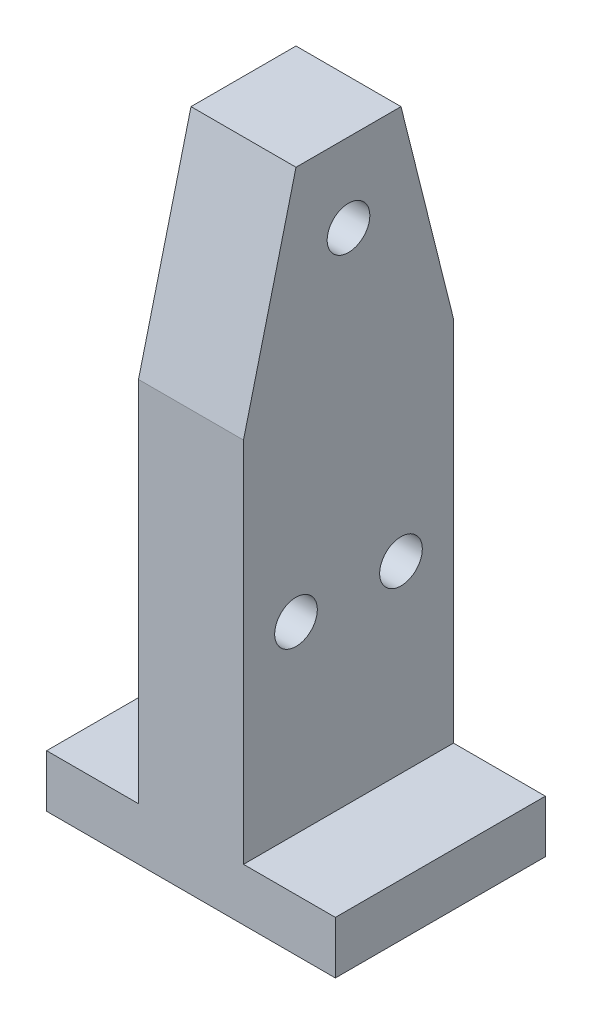
ISO-10303-21;
HEADER;
FILE_DESCRIPTION(('STEP AP214'),'2;1');
FILE_NAME('part.step','',(''),(''),'','','');
FILE_SCHEMA(('AUTOMOTIVE_DESIGN { 1 0 10303 214 1 1 1 1 }'));
ENDSEC;
DATA;
#1=APPLICATION_CONTEXT('core data for automotive mechanical design processes');
#2=APPLICATION_PROTOCOL_DEFINITION('international standard','automotive_design',2000,#1);
#3=PRODUCT_CONTEXT('',#1,'mechanical');
#4=PRODUCT('Part','Part','',(#3));
#5=PRODUCT_RELATED_PRODUCT_CATEGORY('part','',(#4));
#6=PRODUCT_DEFINITION_FORMATION('','',#4);
#7=PRODUCT_DEFINITION_CONTEXT('part definition',#1,'design');
#8=PRODUCT_DEFINITION('design','',#6,#7);
#9=PRODUCT_DEFINITION_SHAPE('','',#8);
#10=(LENGTH_UNIT() NAMED_UNIT(*) SI_UNIT(.MILLI.,.METRE.));
#11=(NAMED_UNIT(*) PLANE_ANGLE_UNIT() SI_UNIT($,.RADIAN.));
#12=(NAMED_UNIT(*) SI_UNIT($,.STERADIAN.) SOLID_ANGLE_UNIT());
#13=UNCERTAINTY_MEASURE_WITH_UNIT(LENGTH_MEASURE(1.E-05),#10,'distance_accuracy_value','');
#14=(GEOMETRIC_REPRESENTATION_CONTEXT(3) GLOBAL_UNCERTAINTY_ASSIGNED_CONTEXT((#13)) GLOBAL_UNIT_ASSIGNED_CONTEXT((#10,
#11,#12)) REPRESENTATION_CONTEXT('',''));
#15=CARTESIAN_POINT('',(0.,0.,0.));
#16=DIRECTION('',(0.,0.,1.));
#17=DIRECTION('',(1.,0.,0.));
#18=AXIS2_PLACEMENT_3D('',#15,#16,#17);
#19=CARTESIAN_POINT('',(-34.925,76.2,25.4));
#20=DIRECTION('',(0.,-1.,0.));
#21=DIRECTION('',(0.,0.,-1.));
#22=AXIS2_PLACEMENT_3D('',#19,#20,#21);
#23=PLANE('',#22);
#24=DIRECTION('',(1.,0.,0.));
#25=VECTOR('',#24,1.);
#26=CARTESIAN_POINT('',(-34.925,76.1999999999999,12.7));
#27=LINE('',#26,#25);
#28=CARTESIAN_POINT('',(-12.7,76.2,12.7));
#29=VERTEX_POINT('',#28);
#30=CARTESIAN_POINT('',(12.7,76.1999999999999,12.7));
#31=VERTEX_POINT('',#30);
#32=EDGE_CURVE('E69',#29,#31,#27,.T.);
#33=ORIENTED_EDGE('',*,*,#32,.T.);
#34=DIRECTION('',(0.,0.,1.));
#35=VECTOR('',#34,1.);
#36=CARTESIAN_POINT('',(12.7,76.2,-25.4));
#37=LINE('',#36,#35);
#38=CARTESIAN_POINT('',(12.7,76.1999999999999,-12.7));
#39=VERTEX_POINT('',#38);
#40=EDGE_CURVE('E176',#39,#31,#37,.T.);
#41=ORIENTED_EDGE('',*,*,#40,.F.);
#42=DIRECTION('',(1.,0.,0.));
#43=VECTOR('',#42,1.);
#44=CARTESIAN_POINT('',(-34.925,76.1999999999999,-12.7));
#45=LINE('',#44,#43);
#46=CARTESIAN_POINT('',(-12.7,76.1999999999999,-12.7));
#47=VERTEX_POINT('',#46);
#48=EDGE_CURVE('E243',#47,#39,#45,.T.);
#49=ORIENTED_EDGE('',*,*,#48,.F.);
#50=DIRECTION('',(0.,0.,1.));
#51=VECTOR('',#50,1.);
#52=CARTESIAN_POINT('',(-12.7,76.2,-25.4));
#53=LINE('',#52,#51);
#54=EDGE_CURVE('E157',#47,#29,#53,.T.);
#55=ORIENTED_EDGE('',*,*,#54,.T.);
#56=EDGE_LOOP('',(#33,#41,#49,#55));
#57=FACE_BOUND('',#56,.T.);
#58=ADVANCED_FACE('F43',(#57),#23,.F.);
#59=CARTESIAN_POINT('',(0.,0.,25.4));
#60=DIRECTION('',(0.,0.,-1.));
#61=DIRECTION('',(-1.,0.,0.));
#62=AXIS2_PLACEMENT_3D('',#59,#60,#61);
#63=PLANE('',#62);
#64=DIRECTION('',(1.,0.,0.));
#65=VECTOR('',#64,1.);
#66=CARTESIAN_POINT('',(-34.925,25.4,25.4));
#67=LINE('',#66,#65);
#68=CARTESIAN_POINT('',(-12.7,25.4,25.4));
#69=VERTEX_POINT('',#68);
#70=CARTESIAN_POINT('',(12.7,25.4,25.4));
#71=VERTEX_POINT('',#70);
#72=EDGE_CURVE('E121',#69,#71,#67,.T.);
#73=ORIENTED_EDGE('',*,*,#72,.F.);
#74=DIRECTION('',(0.,-1.,0.));
#75=VECTOR('',#74,1.);
#76=CARTESIAN_POINT('',(-12.7,76.2,25.4));
#77=LINE('',#76,#75);
#78=CARTESIAN_POINT('',(-12.7,-63.5,25.4));
#79=VERTEX_POINT('',#78);
#80=EDGE_CURVE('E131',#69,#79,#77,.T.);
#81=ORIENTED_EDGE('',*,*,#80,.T.);
#82=DIRECTION('',(-1.,0.,0.));
#83=VECTOR('',#82,1.);
#84=CARTESIAN_POINT('',(-34.925,-63.5,25.4));
#85=LINE('',#84,#83);
#86=CARTESIAN_POINT('',(-34.925,-63.5,25.4));
#87=VERTEX_POINT('',#86);
#88=EDGE_CURVE('E144',#79,#87,#85,.T.);
#89=ORIENTED_EDGE('',*,*,#88,.T.);
#90=DIRECTION('',(0.,-1.,0.));
#91=VECTOR('',#90,1.);
#92=CARTESIAN_POINT('',(-34.925,-76.2,25.4));
#93=LINE('',#92,#91);
#94=CARTESIAN_POINT('',(-34.925,-76.2,25.4));
#95=VERTEX_POINT('',#94);
#96=EDGE_CURVE('E193',#87,#95,#93,.T.);
#97=ORIENTED_EDGE('',*,*,#96,.T.);
#98=DIRECTION('',(1.,0.,0.));
#99=VECTOR('',#98,1.);
#100=CARTESIAN_POINT('',(-34.925,-76.2,25.4));
#101=LINE('',#100,#99);
#102=CARTESIAN_POINT('',(34.925,-76.2,25.4));
#103=VERTEX_POINT('',#102);
#104=EDGE_CURVE('E197',#95,#103,#101,.T.);
#105=ORIENTED_EDGE('',*,*,#104,.T.);
#106=DIRECTION('',(0.,1.,0.));
#107=VECTOR('',#106,1.);
#108=CARTESIAN_POINT('',(34.925,-76.2,25.4));
#109=LINE('',#108,#107);
#110=CARTESIAN_POINT('',(34.925,-63.5,25.4));
#111=VERTEX_POINT('',#110);
#112=EDGE_CURVE('E189',#103,#111,#109,.T.);
#113=ORIENTED_EDGE('',*,*,#112,.T.);
#114=DIRECTION('',(1.,0.,0.));
#115=VECTOR('',#114,1.);
#116=CARTESIAN_POINT('',(34.925,-63.5,25.4));
#117=LINE('',#116,#115);
#118=CARTESIAN_POINT('',(12.7,-63.5,25.4));
#119=VERTEX_POINT('',#118);
#120=EDGE_CURVE('E166',#119,#111,#117,.T.);
#121=ORIENTED_EDGE('',*,*,#120,.F.);
#122=DIRECTION('',(0.,-1.,0.));
#123=VECTOR('',#122,1.);
#124=CARTESIAN_POINT('',(12.7,76.2,25.4));
#125=LINE('',#124,#123);
#126=EDGE_CURVE('E134',#71,#119,#125,.T.);
#127=ORIENTED_EDGE('',*,*,#126,.F.);
#128=EDGE_LOOP('',(#73,#81,#89,#97,#105,#113,#121,#127));
#129=FACE_BOUND('',#128,.T.);
#130=ADVANCED_FACE('F129',(#129),#63,.F.);
#131=CARTESIAN_POINT('',(0.,0.,-25.4));
#132=DIRECTION('',(0.,0.,-1.));
#133=DIRECTION('',(-1.,0.,0.));
#134=AXIS2_PLACEMENT_3D('',#131,#132,#133);
#135=PLANE('',#134);
#136=DIRECTION('',(0.,-1.,0.));
#137=VECTOR('',#136,1.);
#138=CARTESIAN_POINT('',(-12.7,76.2,-25.4));
#139=LINE('',#138,#137);
#140=CARTESIAN_POINT('',(-12.7,25.4,-25.4));
#141=VERTEX_POINT('',#140);
#142=CARTESIAN_POINT('',(-12.7,-63.5,-25.4));
#143=VERTEX_POINT('',#142);
#144=EDGE_CURVE('E148',#141,#143,#139,.T.);
#145=ORIENTED_EDGE('',*,*,#144,.F.);
#146=DIRECTION('',(1.,0.,0.));
#147=VECTOR('',#146,1.);
#148=CARTESIAN_POINT('',(-34.925,25.4,-25.4));
#149=LINE('',#148,#147);
#150=CARTESIAN_POINT('',(12.7,25.4,-25.4));
#151=VERTEX_POINT('',#150);
#152=EDGE_CURVE('E61',#141,#151,#149,.T.);
#153=ORIENTED_EDGE('',*,*,#152,.T.);
#154=DIRECTION('',(0.,-1.,0.));
#155=VECTOR('',#154,1.);
#156=CARTESIAN_POINT('',(12.7,76.2,-25.4));
#157=LINE('',#156,#155);
#158=CARTESIAN_POINT('',(12.7,-63.5,-25.4));
#159=VERTEX_POINT('',#158);
#160=EDGE_CURVE('E169',#151,#159,#157,.T.);
#161=ORIENTED_EDGE('',*,*,#160,.T.);
#162=DIRECTION('',(1.,0.,0.));
#163=VECTOR('',#162,1.);
#164=CARTESIAN_POINT('',(34.925,-63.5,-25.4));
#165=LINE('',#164,#163);
#166=CARTESIAN_POINT('',(34.925,-63.5,-25.4));
#167=VERTEX_POINT('',#166);
#168=EDGE_CURVE('E172',#159,#167,#165,.T.);
#169=ORIENTED_EDGE('',*,*,#168,.T.);
#170=DIRECTION('',(0.,1.,0.));
#171=VECTOR('',#170,1.);
#172=CARTESIAN_POINT('',(34.925,-76.2,-25.4));
#173=LINE('',#172,#171);
#174=CARTESIAN_POINT('',(34.925,-76.2,-25.4));
#175=VERTEX_POINT('',#174);
#176=EDGE_CURVE('E181',#175,#167,#173,.T.);
#177=ORIENTED_EDGE('',*,*,#176,.F.);
#178=DIRECTION('',(1.,0.,0.));
#179=VECTOR('',#178,1.);
#180=CARTESIAN_POINT('',(-34.925,-76.2,-25.4));
#181=LINE('',#180,#179);
#182=CARTESIAN_POINT('',(-34.925,-76.2,-25.4));
#183=VERTEX_POINT('',#182);
#184=EDGE_CURVE('E194',#183,#175,#181,.T.);
#185=ORIENTED_EDGE('',*,*,#184,.F.);
#186=DIRECTION('',(0.,-1.,0.));
#187=VECTOR('',#186,1.);
#188=CARTESIAN_POINT('',(-34.925,-76.2,-25.4));
#189=LINE('',#188,#187);
#190=CARTESIAN_POINT('',(-34.925,-63.5,-25.4));
#191=VERTEX_POINT('',#190);
#192=EDGE_CURVE('E204',#191,#183,#189,.T.);
#193=ORIENTED_EDGE('',*,*,#192,.F.);
#194=DIRECTION('',(-1.,0.,0.));
#195=VECTOR('',#194,1.);
#196=CARTESIAN_POINT('',(-34.925,-63.5,-25.4));
#197=LINE('',#196,#195);
#198=EDGE_CURVE('E143',#143,#191,#197,.T.);
#199=ORIENTED_EDGE('',*,*,#198,.F.);
#200=EDGE_LOOP('',(#145,#153,#161,#169,#177,#185,#193,#199));
#201=FACE_BOUND('',#200,.T.);
#202=ADVANCED_FACE('F261',(#201),#135,.T.);
#203=CARTESIAN_POINT('',(12.7,76.2,-25.4));
#204=DIRECTION('',(-1.,0.,0.));
#205=DIRECTION('',(0.,-1.,0.));
#206=AXIS2_PLACEMENT_3D('',#203,#204,#205);
#207=PLANE('',#206);
#208=CARTESIAN_POINT('',(12.7,-19.05,12.7));
#209=DIRECTION('',(1.,0.,0.));
#210=DIRECTION('',(0.,0.,-1.));
#211=AXIS2_PLACEMENT_3D('',#208,#209,#210);
#212=CIRCLE('',#211,5.15873999999999);
#213=CARTESIAN_POINT('',(12.7,-19.05,7.54126));
#214=VERTEX_POINT('',#213);
#215=EDGE_CURVE('E235',#214,#214,#212,.T.);
#216=ORIENTED_EDGE('',*,*,#215,.F.);
#217=EDGE_LOOP('',(#216));
#218=FACE_BOUND('',#217,.T.);
#219=CARTESIAN_POINT('',(12.7,-19.05,-12.7));
#220=DIRECTION('',(1.,0.,0.));
#221=DIRECTION('',(0.,0.,-1.));
#222=AXIS2_PLACEMENT_3D('',#219,#220,#221);
#223=CIRCLE('',#222,5.15873999999999);
#224=CARTESIAN_POINT('',(12.7,-19.05,-17.85874));
#225=VERTEX_POINT('',#224);
#226=EDGE_CURVE('E225',#225,#225,#223,.T.);
#227=ORIENTED_EDGE('',*,*,#226,.F.);
#228=EDGE_LOOP('',(#227));
#229=FACE_BOUND('',#228,.T.);
#230=CARTESIAN_POINT('',(12.7,57.1499999999999,0.));
#231=DIRECTION('',(-1.,0.,0.));
#232=DIRECTION('',(0.,-1.,0.));
#233=AXIS2_PLACEMENT_3D('',#230,#231,#232);
#234=CIRCLE('',#233,5.15873999999999);
#235=CARTESIAN_POINT('',(12.7,51.99126,0.));
#236=VERTEX_POINT('',#235);
#237=EDGE_CURVE('E221',#236,#236,#234,.T.);
#238=ORIENTED_EDGE('',*,*,#237,.T.);
#239=EDGE_LOOP('',(#238));
#240=FACE_BOUND('',#239,.T.);
#241=DIRECTION('',(0.,0.970142500145332,-0.242535625036333));
#242=VECTOR('',#241,1.);
#243=CARTESIAN_POINT('',(12.7,85.1647058823529,10.4588235294118));
#244=LINE('',#243,#242);
#245=EDGE_CURVE('E150',#71,#31,#244,.T.);
#246=ORIENTED_EDGE('',*,*,#245,.F.);
#247=ORIENTED_EDGE('',*,*,#126,.T.);
#248=DIRECTION('',(0.,0.,1.));
#249=VECTOR('',#248,1.);
#250=CARTESIAN_POINT('',(12.7,-63.5,-25.4));
#251=LINE('',#250,#249);
#252=EDGE_CURVE('E182',#159,#119,#251,.T.);
#253=ORIENTED_EDGE('',*,*,#252,.F.);
#254=ORIENTED_EDGE('',*,*,#160,.F.);
#255=DIRECTION('',(0.,-0.970142500145332,-0.242535625036333));
#256=VECTOR('',#255,1.);
#257=CARTESIAN_POINT('',(12.7,73.2117647058823,-13.4470588235294));
#258=LINE('',#257,#256);
#259=EDGE_CURVE('E136',#39,#151,#258,.T.);
#260=ORIENTED_EDGE('',*,*,#259,.F.);
#261=ORIENTED_EDGE('',*,*,#40,.T.);
#262=EDGE_LOOP('',(#246,#247,#253,#254,#260,#261));
#263=FACE_BOUND('',#262,.T.);
#264=ADVANCED_FACE('F255',(#218,#229,#240,#263),#207,.F.);
#265=CARTESIAN_POINT('',(-12.7,76.2,-25.4));
#266=DIRECTION('',(-1.,0.,0.));
#267=DIRECTION('',(0.,-1.,0.));
#268=AXIS2_PLACEMENT_3D('',#265,#266,#267);
#269=PLANE('',#268);
#270=CARTESIAN_POINT('',(-12.7,-19.05,12.7));
#271=DIRECTION('',(-1.,0.,0.));
#272=DIRECTION('',(0.,-1.,0.));
#273=AXIS2_PLACEMENT_3D('',#270,#271,#272);
#274=CIRCLE('',#273,5.15873999999999);
#275=CARTESIAN_POINT('',(-12.7,-24.20874,12.7));
#276=VERTEX_POINT('',#275);
#277=EDGE_CURVE('E47',#276,#276,#274,.T.);
#278=ORIENTED_EDGE('',*,*,#277,.F.);
#279=EDGE_LOOP('',(#278));
#280=FACE_BOUND('',#279,.T.);
#281=CARTESIAN_POINT('',(-12.7,-19.05,-12.7));
#282=DIRECTION('',(-1.,0.,0.));
#283=DIRECTION('',(0.,-1.,0.));
#284=AXIS2_PLACEMENT_3D('',#281,#282,#283);
#285=CIRCLE('',#284,5.15873999999999);
#286=CARTESIAN_POINT('',(-12.7,-24.20874,-12.7));
#287=VERTEX_POINT('',#286);
#288=EDGE_CURVE('E222',#287,#287,#285,.T.);
#289=ORIENTED_EDGE('',*,*,#288,.F.);
#290=EDGE_LOOP('',(#289));
#291=FACE_BOUND('',#290,.T.);
#292=CARTESIAN_POINT('',(-12.7,57.1499999999999,0.));
#293=DIRECTION('',(-1.,0.,0.));
#294=DIRECTION('',(0.,-1.,0.));
#295=AXIS2_PLACEMENT_3D('',#292,#293,#294);
#296=CIRCLE('',#295,5.15873999999999);
#297=CARTESIAN_POINT('',(-12.7,51.99126,0.));
#298=VERTEX_POINT('',#297);
#299=EDGE_CURVE('E218',#298,#298,#296,.T.);
#300=ORIENTED_EDGE('',*,*,#299,.F.);
#301=EDGE_LOOP('',(#300));
#302=FACE_BOUND('',#301,.T.);
#303=ORIENTED_EDGE('',*,*,#80,.F.);
#304=DIRECTION('',(0.,0.970142500145332,-0.242535625036333));
#305=VECTOR('',#304,1.);
#306=CARTESIAN_POINT('',(-12.7,85.1647058823529,10.4588235294118));
#307=LINE('',#306,#305);
#308=EDGE_CURVE('E13',#69,#29,#307,.T.);
#309=ORIENTED_EDGE('',*,*,#308,.T.);
#310=ORIENTED_EDGE('',*,*,#54,.F.);
#311=DIRECTION('',(0.,-0.970142500145332,-0.242535625036333));
#312=VECTOR('',#311,1.);
#313=CARTESIAN_POINT('',(-12.7,73.2117647058823,-13.4470588235294));
#314=LINE('',#313,#312);
#315=EDGE_CURVE('E53',#47,#141,#314,.T.);
#316=ORIENTED_EDGE('',*,*,#315,.T.);
#317=ORIENTED_EDGE('',*,*,#144,.T.);
#318=DIRECTION('',(0.,0.,1.));
#319=VECTOR('',#318,1.);
#320=CARTESIAN_POINT('',(-12.7,-63.5,-25.4));
#321=LINE('',#320,#319);
#322=EDGE_CURVE('E140',#143,#79,#321,.T.);
#323=ORIENTED_EDGE('',*,*,#322,.T.);
#324=EDGE_LOOP('',(#303,#309,#310,#316,#317,#323));
#325=FACE_BOUND('',#324,.T.);
#326=ADVANCED_FACE('F138',(#280,#291,#302,#325),#269,.T.);
#327=CARTESIAN_POINT('',(-34.925,-76.2,25.4));
#328=DIRECTION('',(1.,0.,0.));
#329=DIRECTION('',(0.,0.,-1.));
#330=AXIS2_PLACEMENT_3D('',#327,#328,#329);
#331=PLANE('',#330);
#332=DIRECTION('',(0.,0.,1.));
#333=VECTOR('',#332,1.);
#334=CARTESIAN_POINT('',(-34.925,-63.5,-25.4));
#335=LINE('',#334,#333);
#336=EDGE_CURVE('E156',#191,#87,#335,.T.);
#337=ORIENTED_EDGE('',*,*,#336,.F.);
#338=ORIENTED_EDGE('',*,*,#192,.T.);
#339=DIRECTION('',(0.,0.,-1.));
#340=VECTOR('',#339,1.);
#341=CARTESIAN_POINT('',(-34.925,-76.2,25.4));
#342=LINE('',#341,#340);
#343=EDGE_CURVE('E212',#95,#183,#342,.T.);
#344=ORIENTED_EDGE('',*,*,#343,.F.);
#345=ORIENTED_EDGE('',*,*,#96,.F.);
#346=EDGE_LOOP('',(#337,#338,#344,#345));
#347=FACE_BOUND('',#346,.T.);
#348=ADVANCED_FACE('F271',(#347),#331,.F.);
#349=CARTESIAN_POINT('',(34.925,-76.2,25.4));
#350=DIRECTION('',(-1.,0.,0.));
#351=DIRECTION('',(0.,0.,1.));
#352=AXIS2_PLACEMENT_3D('',#349,#350,#351);
#353=PLANE('',#352);
#354=ORIENTED_EDGE('',*,*,#176,.T.);
#355=DIRECTION('',(0.,0.,1.));
#356=VECTOR('',#355,1.);
#357=CARTESIAN_POINT('',(34.925,-63.5,-25.4));
#358=LINE('',#357,#356);
#359=EDGE_CURVE('E177',#167,#111,#358,.T.);
#360=ORIENTED_EDGE('',*,*,#359,.T.);
#361=ORIENTED_EDGE('',*,*,#112,.F.);
#362=DIRECTION('',(0.,0.,-1.));
#363=VECTOR('',#362,1.);
#364=CARTESIAN_POINT('',(34.925,-76.2,25.4));
#365=LINE('',#364,#363);
#366=EDGE_CURVE('E200',#103,#175,#365,.T.);
#367=ORIENTED_EDGE('',*,*,#366,.T.);
#368=EDGE_LOOP('',(#354,#360,#361,#367));
#369=FACE_BOUND('',#368,.T.);
#370=ADVANCED_FACE('F45',(#369),#353,.F.);
#371=CARTESIAN_POINT('',(-34.925,-76.2,25.4));
#372=DIRECTION('',(0.,1.,0.));
#373=DIRECTION('',(0.,0.,1.));
#374=AXIS2_PLACEMENT_3D('',#371,#372,#373);
#375=PLANE('',#374);
#376=ORIENTED_EDGE('',*,*,#184,.T.);
#377=ORIENTED_EDGE('',*,*,#366,.F.);
#378=ORIENTED_EDGE('',*,*,#104,.F.);
#379=ORIENTED_EDGE('',*,*,#343,.T.);
#380=EDGE_LOOP('',(#376,#377,#378,#379));
#381=FACE_BOUND('',#380,.T.);
#382=ADVANCED_FACE('F276',(#381),#375,.F.);
#383=CARTESIAN_POINT('',(34.925,-63.5,-25.4));
#384=DIRECTION('',(0.,-1.,0.));
#385=DIRECTION('',(0.,0.,-1.));
#386=AXIS2_PLACEMENT_3D('',#383,#384,#385);
#387=PLANE('',#386);
#388=ORIENTED_EDGE('',*,*,#359,.F.);
#389=ORIENTED_EDGE('',*,*,#168,.F.);
#390=ORIENTED_EDGE('',*,*,#252,.T.);
#391=ORIENTED_EDGE('',*,*,#120,.T.);
#392=EDGE_LOOP('',(#388,#389,#390,#391));
#393=FACE_BOUND('',#392,.T.);
#394=ADVANCED_FACE('F281',(#393),#387,.F.);
#395=CARTESIAN_POINT('',(-34.925,-63.5,-25.4));
#396=DIRECTION('',(0.,1.,0.));
#397=DIRECTION('',(0.,0.,1.));
#398=AXIS2_PLACEMENT_3D('',#395,#396,#397);
#399=PLANE('',#398);
#400=ORIENTED_EDGE('',*,*,#322,.F.);
#401=ORIENTED_EDGE('',*,*,#198,.T.);
#402=ORIENTED_EDGE('',*,*,#336,.T.);
#403=ORIENTED_EDGE('',*,*,#88,.F.);
#404=EDGE_LOOP('',(#400,#401,#402,#403));
#405=FACE_BOUND('',#404,.T.);
#406=ADVANCED_FACE('F266',(#405),#399,.T.);
#407=CARTESIAN_POINT('',(-34.925,76.1999999999999,-12.7));
#408=DIRECTION('',(0.,0.242535625036333,-0.970142500145332));
#409=DIRECTION('',(0.,0.970142500145332,0.242535625036333));
#410=AXIS2_PLACEMENT_3D('',#407,#408,#409);
#411=PLANE('',#410);
#412=ORIENTED_EDGE('',*,*,#259,.T.);
#413=ORIENTED_EDGE('',*,*,#152,.F.);
#414=ORIENTED_EDGE('',*,*,#315,.F.);
#415=ORIENTED_EDGE('',*,*,#48,.T.);
#416=EDGE_LOOP('',(#412,#413,#414,#415));
#417=FACE_BOUND('',#416,.T.);
#418=ADVANCED_FACE('F258',(#417),#411,.T.);
#419=CARTESIAN_POINT('',(-34.925,76.1999999999999,12.7));
#420=DIRECTION('',(0.,0.242535625036333,0.970142500145332));
#421=DIRECTION('',(0.,-0.970142500145332,0.242535625036333));
#422=AXIS2_PLACEMENT_3D('',#419,#420,#421);
#423=PLANE('',#422);
#424=ORIENTED_EDGE('',*,*,#245,.T.);
#425=ORIENTED_EDGE('',*,*,#32,.F.);
#426=ORIENTED_EDGE('',*,*,#308,.F.);
#427=ORIENTED_EDGE('',*,*,#72,.T.);
#428=EDGE_LOOP('',(#424,#425,#426,#427));
#429=FACE_BOUND('',#428,.T.);
#430=ADVANCED_FACE('F120',(#429),#423,.T.);
#431=CARTESIAN_POINT('',(-34.925,57.1499999999999,0.));
#432=DIRECTION('',(-1.,0.,0.));
#433=DIRECTION('',(0.,0.,1.));
#434=AXIS2_PLACEMENT_3D('',#431,#432,#433);
#435=CYLINDRICAL_SURFACE('',#434,5.15873999999999);
#436=ORIENTED_EDGE('',*,*,#299,.T.);
#437=EDGE_LOOP('',(#436));
#438=FACE_BOUND('',#437,.T.);
#439=ORIENTED_EDGE('',*,*,#237,.F.);
#440=EDGE_LOOP('',(#439));
#441=FACE_BOUND('',#440,.T.);
#442=ADVANCED_FACE('F313',(#438,#441),#435,.F.);
#443=CARTESIAN_POINT('',(12.7,-19.05,-12.7));
#444=DIRECTION('',(1.,0.,0.));
#445=DIRECTION('',(0.,0.,-1.));
#446=AXIS2_PLACEMENT_3D('',#443,#444,#445);
#447=CYLINDRICAL_SURFACE('',#446,5.15873999999999);
#448=ORIENTED_EDGE('',*,*,#288,.T.);
#449=EDGE_LOOP('',(#448));
#450=FACE_BOUND('',#449,.T.);
#451=ORIENTED_EDGE('',*,*,#226,.T.);
#452=EDGE_LOOP('',(#451));
#453=FACE_BOUND('',#452,.T.);
#454=ADVANCED_FACE('F315',(#450,#453),#447,.F.);
#455=CARTESIAN_POINT('',(12.7,-19.05,12.7));
#456=DIRECTION('',(1.,0.,0.));
#457=DIRECTION('',(0.,0.,-1.));
#458=AXIS2_PLACEMENT_3D('',#455,#456,#457);
#459=CYLINDRICAL_SURFACE('',#458,5.15873999999999);
#460=ORIENTED_EDGE('',*,*,#277,.T.);
#461=EDGE_LOOP('',(#460));
#462=FACE_BOUND('',#461,.T.);
#463=ORIENTED_EDGE('',*,*,#215,.T.);
#464=EDGE_LOOP('',(#463));
#465=FACE_BOUND('',#464,.T.);
#466=ADVANCED_FACE('F322',(#462,#465),#459,.F.);
#467=CLOSED_SHELL('',(#58,#130,#202,#264,#326,#348,#370,#382,#394,#406,#418,#430,#442,#454,#466));
#468=MANIFOLD_SOLID_BREP('B2',#467);
#469=ADVANCED_BREP_SHAPE_REPRESENTATION('',(#18,#468),#14);
#470=SHAPE_DEFINITION_REPRESENTATION(#9,#469);
ENDSEC;
END-ISO-10303-21;
